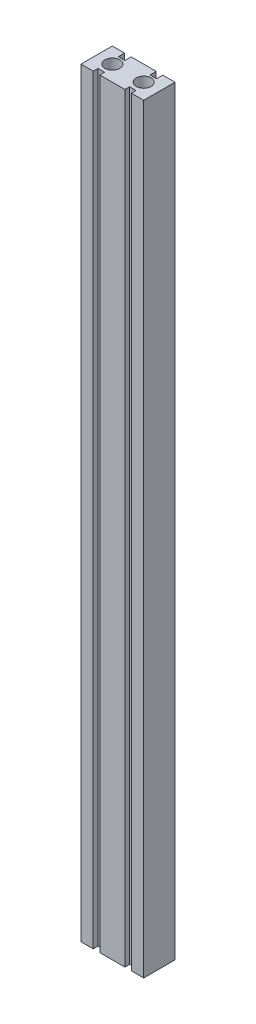
ISO-10303-21;
HEADER;
FILE_DESCRIPTION(('STEP AP214'),'2;1');
FILE_NAME('part.step','',(''),(''),'','','');
FILE_SCHEMA(('AUTOMOTIVE_DESIGN { 1 0 10303 214 1 1 1 1 }'));
ENDSEC;
DATA;
#1=APPLICATION_CONTEXT('core data for automotive mechanical design processes');
#2=APPLICATION_PROTOCOL_DEFINITION('international standard','automotive_design',2000,#1);
#3=PRODUCT_CONTEXT('',#1,'mechanical');
#4=PRODUCT('Part','Part','',(#3));
#5=PRODUCT_RELATED_PRODUCT_CATEGORY('part','',(#4));
#6=PRODUCT_DEFINITION_FORMATION('','',#4);
#7=PRODUCT_DEFINITION_CONTEXT('part definition',#1,'design');
#8=PRODUCT_DEFINITION('design','',#6,#7);
#9=PRODUCT_DEFINITION_SHAPE('','',#8);
#10=(LENGTH_UNIT() NAMED_UNIT(*) SI_UNIT(.MILLI.,.METRE.));
#11=(NAMED_UNIT(*) PLANE_ANGLE_UNIT() SI_UNIT($,.RADIAN.));
#12=(NAMED_UNIT(*) SI_UNIT($,.STERADIAN.) SOLID_ANGLE_UNIT());
#13=UNCERTAINTY_MEASURE_WITH_UNIT(LENGTH_MEASURE(1.E-05),#10,'distance_accuracy_value','');
#14=(GEOMETRIC_REPRESENTATION_CONTEXT(3) GLOBAL_UNCERTAINTY_ASSIGNED_CONTEXT((#13)) GLOBAL_UNIT_ASSIGNED_CONTEXT((#10,
#11,#12)) REPRESENTATION_CONTEXT('',''));
#15=CARTESIAN_POINT('',(0.,0.,0.));
#16=DIRECTION('',(0.,0.,1.));
#17=DIRECTION('',(1.,0.,0.));
#18=AXIS2_PLACEMENT_3D('',#15,#16,#17);
#19=CARTESIAN_POINT('',(-20.,485.,-10.));
#20=DIRECTION('',(0.,0.,1.));
#21=DIRECTION('',(1.,0.,0.));
#22=AXIS2_PLACEMENT_3D('',#19,#20,#21);
#23=PLANE('',#22);
#24=DIRECTION('',(-1.,0.,0.));
#25=VECTOR('',#24,1.);
#26=CARTESIAN_POINT('',(-20.,0.,-10.));
#27=LINE('',#26,#25);
#28=CARTESIAN_POINT('',(20.,0.,-10.));
#29=VERTEX_POINT('',#28);
#30=CARTESIAN_POINT('',(12.2,0.,-10.));
#31=VERTEX_POINT('',#30);
#32=EDGE_CURVE('E309',#29,#31,#27,.T.);
#33=ORIENTED_EDGE('',*,*,#32,.T.);
#34=DIRECTION('',(0.,-1.,0.));
#35=VECTOR('',#34,1.);
#36=CARTESIAN_POINT('',(12.2,485.,-10.));
#37=LINE('',#36,#35);
#38=CARTESIAN_POINT('',(12.2,485.,-10.));
#39=VERTEX_POINT('',#38);
#40=EDGE_CURVE('E219',#39,#31,#37,.T.);
#41=ORIENTED_EDGE('',*,*,#40,.F.);
#42=DIRECTION('',(-1.,0.,0.));
#43=VECTOR('',#42,1.);
#44=CARTESIAN_POINT('',(-20.,485.,-10.));
#45=LINE('',#44,#43);
#46=CARTESIAN_POINT('',(20.,485.,-10.));
#47=VERTEX_POINT('',#46);
#48=EDGE_CURVE('E294',#47,#39,#45,.T.);
#49=ORIENTED_EDGE('',*,*,#48,.F.);
#50=DIRECTION('',(0.,-1.,0.));
#51=VECTOR('',#50,1.);
#52=CARTESIAN_POINT('',(20.,485.,-10.));
#53=LINE('',#52,#51);
#54=EDGE_CURVE('E11',#47,#29,#53,.T.);
#55=ORIENTED_EDGE('',*,*,#54,.T.);
#56=EDGE_LOOP('',(#33,#41,#49,#55));
#57=FACE_BOUND('',#56,.T.);
#58=ADVANCED_FACE('F37',(#57),#23,.F.);
#59=CARTESIAN_POINT('',(-12.2,485.,-10.));
#60=VERTEX_POINT('',#59);
#61=CARTESIAN_POINT('',(-20.,485.,-10.));
#62=VERTEX_POINT('',#61);
#63=EDGE_CURVE('E292',#60,#62,#45,.T.);
#64=ORIENTED_EDGE('',*,*,#63,.F.);
#65=DIRECTION('',(0.,1.,0.));
#66=VECTOR('',#65,1.);
#67=CARTESIAN_POINT('',(-12.2,0.,-10.));
#68=LINE('',#67,#66);
#69=CARTESIAN_POINT('',(-12.2,0.,-10.));
#70=VERTEX_POINT('',#69);
#71=EDGE_CURVE('E214',#70,#60,#68,.T.);
#72=ORIENTED_EDGE('',*,*,#71,.F.);
#73=CARTESIAN_POINT('',(-20.,0.,-10.));
#74=VERTEX_POINT('',#73);
#75=EDGE_CURVE('E308',#70,#74,#27,.T.);
#76=ORIENTED_EDGE('',*,*,#75,.T.);
#77=DIRECTION('',(0.,-1.,0.));
#78=VECTOR('',#77,1.);
#79=CARTESIAN_POINT('',(-20.,485.,-10.));
#80=LINE('',#79,#78);
#81=EDGE_CURVE('E45',#62,#74,#80,.T.);
#82=ORIENTED_EDGE('',*,*,#81,.F.);
#83=EDGE_LOOP('',(#64,#72,#76,#82));
#84=FACE_BOUND('',#83,.T.);
#85=ADVANCED_FACE('F361',(#84),#23,.F.);
#86=CARTESIAN_POINT('',(-20.,485.,10.));
#87=DIRECTION('',(0.,0.,-1.));
#88=DIRECTION('',(-1.,0.,0.));
#89=AXIS2_PLACEMENT_3D('',#86,#87,#88);
#90=PLANE('',#89);
#91=DIRECTION('',(1.,0.,0.));
#92=VECTOR('',#91,1.);
#93=CARTESIAN_POINT('',(-20.,0.,10.));
#94=LINE('',#93,#92);
#95=CARTESIAN_POINT('',(-20.,0.,10.));
#96=VERTEX_POINT('',#95);
#97=CARTESIAN_POINT('',(-12.2,0.,10.));
#98=VERTEX_POINT('',#97);
#99=EDGE_CURVE('E293',#96,#98,#94,.T.);
#100=ORIENTED_EDGE('',*,*,#99,.T.);
#101=DIRECTION('',(0.,-1.,0.));
#102=VECTOR('',#101,1.);
#103=CARTESIAN_POINT('',(-12.2,0.,10.));
#104=LINE('',#103,#102);
#105=CARTESIAN_POINT('',(-12.2,485.,10.));
#106=VERTEX_POINT('',#105);
#107=EDGE_CURVE('E239',#106,#98,#104,.T.);
#108=ORIENTED_EDGE('',*,*,#107,.F.);
#109=DIRECTION('',(1.,0.,0.));
#110=VECTOR('',#109,1.);
#111=CARTESIAN_POINT('',(-20.,485.,10.));
#112=LINE('',#111,#110);
#113=CARTESIAN_POINT('',(-20.,485.,10.));
#114=VERTEX_POINT('',#113);
#115=EDGE_CURVE('E301',#114,#106,#112,.T.);
#116=ORIENTED_EDGE('',*,*,#115,.F.);
#117=DIRECTION('',(0.,-1.,0.));
#118=VECTOR('',#117,1.);
#119=CARTESIAN_POINT('',(-20.,485.,10.));
#120=LINE('',#119,#118);
#121=EDGE_CURVE('E320',#114,#96,#120,.T.);
#122=ORIENTED_EDGE('',*,*,#121,.T.);
#123=EDGE_LOOP('',(#100,#108,#116,#122));
#124=FACE_BOUND('',#123,.T.);
#125=ADVANCED_FACE('F338',(#124),#90,.F.);
#126=CARTESIAN_POINT('',(12.2,485.,10.));
#127=VERTEX_POINT('',#126);
#128=CARTESIAN_POINT('',(20.,485.,10.));
#129=VERTEX_POINT('',#128);
#130=EDGE_CURVE('E300',#127,#129,#112,.T.);
#131=ORIENTED_EDGE('',*,*,#130,.F.);
#132=DIRECTION('',(0.,1.,0.));
#133=VECTOR('',#132,1.);
#134=CARTESIAN_POINT('',(12.2,0.,10.));
#135=LINE('',#134,#133);
#136=CARTESIAN_POINT('',(12.2,0.,10.));
#137=VERTEX_POINT('',#136);
#138=EDGE_CURVE('E266',#137,#127,#135,.T.);
#139=ORIENTED_EDGE('',*,*,#138,.F.);
#140=CARTESIAN_POINT('',(20.,0.,10.));
#141=VERTEX_POINT('',#140);
#142=EDGE_CURVE('E314',#137,#141,#94,.T.);
#143=ORIENTED_EDGE('',*,*,#142,.T.);
#144=DIRECTION('',(0.,-1.,0.));
#145=VECTOR('',#144,1.);
#146=CARTESIAN_POINT('',(20.,485.,10.));
#147=LINE('',#146,#145);
#148=EDGE_CURVE('E304',#129,#141,#147,.T.);
#149=ORIENTED_EDGE('',*,*,#148,.F.);
#150=EDGE_LOOP('',(#131,#139,#143,#149));
#151=FACE_BOUND('',#150,.T.);
#152=ADVANCED_FACE('F367',(#151),#90,.F.);
#153=CARTESIAN_POINT('',(20.,485.,-10.));
#154=DIRECTION('',(-1.,0.,0.));
#155=DIRECTION('',(0.,0.,1.));
#156=AXIS2_PLACEMENT_3D('',#153,#154,#155);
#157=PLANE('',#156);
#158=DIRECTION('',(0.,0.,-1.));
#159=VECTOR('',#158,1.);
#160=CARTESIAN_POINT('',(20.,0.,-10.));
#161=LINE('',#160,#159);
#162=EDGE_CURVE('E280',#141,#29,#161,.T.);
#163=ORIENTED_EDGE('',*,*,#162,.T.);
#164=ORIENTED_EDGE('',*,*,#54,.F.);
#165=DIRECTION('',(0.,0.,-1.));
#166=VECTOR('',#165,1.);
#167=CARTESIAN_POINT('',(20.,485.,-10.));
#168=LINE('',#167,#166);
#169=EDGE_CURVE('E289',#129,#47,#168,.T.);
#170=ORIENTED_EDGE('',*,*,#169,.F.);
#171=ORIENTED_EDGE('',*,*,#148,.T.);
#172=EDGE_LOOP('',(#163,#164,#170,#171));
#173=FACE_BOUND('',#172,.T.);
#174=ADVANCED_FACE('F39',(#173),#157,.F.);
#175=CARTESIAN_POINT('',(8.,485.,-10.));
#176=VERTEX_POINT('',#175);
#177=CARTESIAN_POINT('',(-8.,485.,-10.));
#178=VERTEX_POINT('',#177);
#179=EDGE_CURVE('E298',#176,#178,#45,.T.);
#180=ORIENTED_EDGE('',*,*,#179,.F.);
#181=DIRECTION('',(0.,1.,0.));
#182=VECTOR('',#181,1.);
#183=CARTESIAN_POINT('',(8.,0.,-10.));
#184=LINE('',#183,#182);
#185=CARTESIAN_POINT('',(8.,0.,-10.));
#186=VERTEX_POINT('',#185);
#187=EDGE_CURVE('E354',#186,#176,#184,.T.);
#188=ORIENTED_EDGE('',*,*,#187,.F.);
#189=CARTESIAN_POINT('',(-8.,0.,-10.));
#190=VERTEX_POINT('',#189);
#191=EDGE_CURVE('E196',#186,#190,#27,.T.);
#192=ORIENTED_EDGE('',*,*,#191,.T.);
#193=DIRECTION('',(0.,-1.,0.));
#194=VECTOR('',#193,1.);
#195=CARTESIAN_POINT('',(-8.,485.,-10.));
#196=LINE('',#195,#194);
#197=EDGE_CURVE('E208',#178,#190,#196,.T.);
#198=ORIENTED_EDGE('',*,*,#197,.F.);
#199=EDGE_LOOP('',(#180,#188,#192,#198));
#200=FACE_BOUND('',#199,.T.);
#201=ADVANCED_FACE('F353',(#200),#23,.F.);
#202=CARTESIAN_POINT('',(-20.,485.,-10.));
#203=DIRECTION('',(1.,0.,0.));
#204=DIRECTION('',(0.,0.,-1.));
#205=AXIS2_PLACEMENT_3D('',#202,#203,#204);
#206=PLANE('',#205);
#207=DIRECTION('',(0.,0.,1.));
#208=VECTOR('',#207,1.);
#209=CARTESIAN_POINT('',(-20.,0.,-10.));
#210=LINE('',#209,#208);
#211=EDGE_CURVE('E312',#74,#96,#210,.T.);
#212=ORIENTED_EDGE('',*,*,#211,.T.);
#213=ORIENTED_EDGE('',*,*,#121,.F.);
#214=DIRECTION('',(0.,0.,1.));
#215=VECTOR('',#214,1.);
#216=CARTESIAN_POINT('',(-20.,485.,-10.));
#217=LINE('',#216,#215);
#218=EDGE_CURVE('E297',#62,#114,#217,.T.);
#219=ORIENTED_EDGE('',*,*,#218,.F.);
#220=ORIENTED_EDGE('',*,*,#81,.T.);
#221=EDGE_LOOP('',(#212,#213,#219,#220));
#222=FACE_BOUND('',#221,.T.);
#223=ADVANCED_FACE('F327',(#222),#206,.F.);
#224=CARTESIAN_POINT('',(-8.,485.,10.));
#225=VERTEX_POINT('',#224);
#226=CARTESIAN_POINT('',(8.,485.,10.));
#227=VERTEX_POINT('',#226);
#228=EDGE_CURVE('E305',#225,#227,#112,.T.);
#229=ORIENTED_EDGE('',*,*,#228,.F.);
#230=DIRECTION('',(0.,1.,0.));
#231=VECTOR('',#230,1.);
#232=CARTESIAN_POINT('',(-8.,0.,10.));
#233=LINE('',#232,#231);
#234=CARTESIAN_POINT('',(-8.,0.,10.));
#235=VERTEX_POINT('',#234);
#236=EDGE_CURVE('E229',#235,#225,#233,.T.);
#237=ORIENTED_EDGE('',*,*,#236,.F.);
#238=CARTESIAN_POINT('',(8.,0.,10.));
#239=VERTEX_POINT('',#238);
#240=EDGE_CURVE('E317',#235,#239,#94,.T.);
#241=ORIENTED_EDGE('',*,*,#240,.T.);
#242=DIRECTION('',(0.,-1.,0.));
#243=VECTOR('',#242,1.);
#244=CARTESIAN_POINT('',(8.,0.,10.));
#245=LINE('',#244,#243);
#246=EDGE_CURVE('E257',#227,#239,#245,.T.);
#247=ORIENTED_EDGE('',*,*,#246,.F.);
#248=EDGE_LOOP('',(#229,#237,#241,#247));
#249=FACE_BOUND('',#248,.T.);
#250=ADVANCED_FACE('F369',(#249),#90,.F.);
#251=CARTESIAN_POINT('',(0.,485.,0.));
#252=DIRECTION('',(0.,1.,0.));
#253=DIRECTION('',(0.,0.,1.));
#254=AXIS2_PLACEMENT_3D('',#251,#252,#253);
#255=PLANE('',#254);
#256=DIRECTION('',(0.,0.,-1.));
#257=VECTOR('',#256,1.);
#258=CARTESIAN_POINT('',(12.2,485.,-6.));
#259=LINE('',#258,#257);
#260=CARTESIAN_POINT('',(12.2,485.,-6.));
#261=VERTEX_POINT('',#260);
#262=EDGE_CURVE('E199',#261,#39,#259,.T.);
#263=ORIENTED_EDGE('',*,*,#262,.F.);
#264=DIRECTION('',(1.,0.,0.));
#265=VECTOR('',#264,1.);
#266=CARTESIAN_POINT('',(8.,485.,-6.));
#267=LINE('',#266,#265);
#268=CARTESIAN_POINT('',(8.,485.,-6.));
#269=VERTEX_POINT('',#268);
#270=EDGE_CURVE('E183',#269,#261,#267,.T.);
#271=ORIENTED_EDGE('',*,*,#270,.F.);
#272=DIRECTION('',(0.,0.,-1.));
#273=VECTOR('',#272,1.);
#274=CARTESIAN_POINT('',(8.,485.,-6.));
#275=LINE('',#274,#273);
#276=EDGE_CURVE('E181',#269,#176,#275,.T.);
#277=ORIENTED_EDGE('',*,*,#276,.T.);
#278=ORIENTED_EDGE('',*,*,#179,.T.);
#279=DIRECTION('',(0.,0.,-1.));
#280=VECTOR('',#279,1.);
#281=CARTESIAN_POINT('',(-8.,485.,-6.));
#282=LINE('',#281,#280);
#283=CARTESIAN_POINT('',(-8.,485.,-6.));
#284=VERTEX_POINT('',#283);
#285=EDGE_CURVE('E222',#284,#178,#282,.T.);
#286=ORIENTED_EDGE('',*,*,#285,.F.);
#287=DIRECTION('',(1.,0.,0.));
#288=VECTOR('',#287,1.);
#289=CARTESIAN_POINT('',(-12.2,485.,-6.));
#290=LINE('',#289,#288);
#291=CARTESIAN_POINT('',(-12.2,485.,-6.));
#292=VERTEX_POINT('',#291);
#293=EDGE_CURVE('E207',#292,#284,#290,.T.);
#294=ORIENTED_EDGE('',*,*,#293,.F.);
#295=DIRECTION('',(0.,0.,-1.));
#296=VECTOR('',#295,1.);
#297=CARTESIAN_POINT('',(-12.2,485.,-6.));
#298=LINE('',#297,#296);
#299=EDGE_CURVE('E213',#292,#60,#298,.T.);
#300=ORIENTED_EDGE('',*,*,#299,.T.);
#301=ORIENTED_EDGE('',*,*,#63,.T.);
#302=ORIENTED_EDGE('',*,*,#218,.T.);
#303=ORIENTED_EDGE('',*,*,#115,.T.);
#304=DIRECTION('',(0.,0.,1.));
#305=VECTOR('',#304,1.);
#306=CARTESIAN_POINT('',(-12.2,485.,7.));
#307=LINE('',#306,#305);
#308=CARTESIAN_POINT('',(-12.2,485.,7.));
#309=VERTEX_POINT('',#308);
#310=EDGE_CURVE('E243',#309,#106,#307,.T.);
#311=ORIENTED_EDGE('',*,*,#310,.F.);
#312=DIRECTION('',(-1.,0.,0.));
#313=VECTOR('',#312,1.);
#314=CARTESIAN_POINT('',(-12.2,485.,7.));
#315=LINE('',#314,#313);
#316=CARTESIAN_POINT('',(-8.,485.,7.));
#317=VERTEX_POINT('',#316);
#318=EDGE_CURVE('E235',#317,#309,#315,.T.);
#319=ORIENTED_EDGE('',*,*,#318,.F.);
#320=DIRECTION('',(0.,0.,1.));
#321=VECTOR('',#320,1.);
#322=CARTESIAN_POINT('',(-8.,485.,7.));
#323=LINE('',#322,#321);
#324=EDGE_CURVE('E246',#317,#225,#323,.T.);
#325=ORIENTED_EDGE('',*,*,#324,.T.);
#326=ORIENTED_EDGE('',*,*,#228,.T.);
#327=DIRECTION('',(0.,0.,1.));
#328=VECTOR('',#327,1.);
#329=CARTESIAN_POINT('',(8.,485.,7.));
#330=LINE('',#329,#328);
#331=CARTESIAN_POINT('',(8.,485.,7.));
#332=VERTEX_POINT('',#331);
#333=EDGE_CURVE('E273',#332,#227,#330,.T.);
#334=ORIENTED_EDGE('',*,*,#333,.F.);
#335=DIRECTION('',(-1.,0.,0.));
#336=VECTOR('',#335,1.);
#337=CARTESIAN_POINT('',(12.2,485.,7.));
#338=LINE('',#337,#336);
#339=CARTESIAN_POINT('',(12.2,485.,7.));
#340=VERTEX_POINT('',#339);
#341=EDGE_CURVE('E256',#340,#332,#338,.T.);
#342=ORIENTED_EDGE('',*,*,#341,.F.);
#343=DIRECTION('',(0.,0.,1.));
#344=VECTOR('',#343,1.);
#345=CARTESIAN_POINT('',(12.2,485.,7.));
#346=LINE('',#345,#344);
#347=EDGE_CURVE('E265',#340,#127,#346,.T.);
#348=ORIENTED_EDGE('',*,*,#347,.T.);
#349=ORIENTED_EDGE('',*,*,#130,.T.);
#350=ORIENTED_EDGE('',*,*,#169,.T.);
#351=ORIENTED_EDGE('',*,*,#48,.T.);
#352=EDGE_LOOP('',(#263,#271,#277,#278,#286,#294,#300,#301,#302,#303,#311,#319,#325,#326,#334,
#342,#348,#349,#350,#351));
#353=FACE_BOUND('',#352,.T.);
#354=CARTESIAN_POINT('',(-10.,485.,0.));
#355=DIRECTION('',(0.,-1.,0.));
#356=DIRECTION('',(0.,0.,-1.));
#357=AXIS2_PLACEMENT_3D('',#354,#355,#356);
#358=CIRCLE('',#357,4.75);
#359=CARTESIAN_POINT('',(-10.,485.,-4.75));
#360=VERTEX_POINT('',#359);
#361=EDGE_CURVE('E277',#360,#360,#358,.T.);
#362=ORIENTED_EDGE('',*,*,#361,.T.);
#363=EDGE_LOOP('',(#362));
#364=FACE_BOUND('',#363,.T.);
#365=CARTESIAN_POINT('',(10.,485.,0.));
#366=DIRECTION('',(0.,-1.,0.));
#367=DIRECTION('',(0.,0.,1.));
#368=AXIS2_PLACEMENT_3D('',#365,#366,#367);
#369=CIRCLE('',#368,4.75);
#370=CARTESIAN_POINT('',(10.,485.,4.75));
#371=VERTEX_POINT('',#370);
#372=EDGE_CURVE('E284',#371,#371,#369,.T.);
#373=ORIENTED_EDGE('',*,*,#372,.T.);
#374=EDGE_LOOP('',(#373));
#375=FACE_BOUND('',#374,.T.);
#376=ADVANCED_FACE('F343',(#353,#364,#375),#255,.T.);
#377=CARTESIAN_POINT('',(0.,0.,0.));
#378=DIRECTION('',(0.,1.,0.));
#379=DIRECTION('',(0.,0.,1.));
#380=AXIS2_PLACEMENT_3D('',#377,#378,#379);
#381=PLANE('',#380);
#382=DIRECTION('',(-1.,0.,0.));
#383=VECTOR('',#382,1.);
#384=CARTESIAN_POINT('',(12.2,0.,-6.));
#385=LINE('',#384,#383);
#386=CARTESIAN_POINT('',(12.2,0.,-6.));
#387=VERTEX_POINT('',#386);
#388=CARTESIAN_POINT('',(8.,0.,-6.));
#389=VERTEX_POINT('',#388);
#390=EDGE_CURVE('E184',#387,#389,#385,.T.);
#391=ORIENTED_EDGE('',*,*,#390,.F.);
#392=DIRECTION('',(0.,0.,-1.));
#393=VECTOR('',#392,1.);
#394=CARTESIAN_POINT('',(12.2,0.,-6.));
#395=LINE('',#394,#393);
#396=EDGE_CURVE('E197',#387,#31,#395,.T.);
#397=ORIENTED_EDGE('',*,*,#396,.T.);
#398=ORIENTED_EDGE('',*,*,#32,.F.);
#399=ORIENTED_EDGE('',*,*,#162,.F.);
#400=ORIENTED_EDGE('',*,*,#142,.F.);
#401=DIRECTION('',(0.,0.,1.));
#402=VECTOR('',#401,1.);
#403=CARTESIAN_POINT('',(12.2,0.,7.));
#404=LINE('',#403,#402);
#405=CARTESIAN_POINT('',(12.2,0.,7.));
#406=VERTEX_POINT('',#405);
#407=EDGE_CURVE('E241',#406,#137,#404,.T.);
#408=ORIENTED_EDGE('',*,*,#407,.F.);
#409=DIRECTION('',(1.,0.,0.));
#410=VECTOR('',#409,1.);
#411=CARTESIAN_POINT('',(12.2,0.,7.));
#412=LINE('',#411,#410);
#413=CARTESIAN_POINT('',(8.,0.,7.));
#414=VERTEX_POINT('',#413);
#415=EDGE_CURVE('E262',#414,#406,#412,.T.);
#416=ORIENTED_EDGE('',*,*,#415,.F.);
#417=DIRECTION('',(0.,0.,1.));
#418=VECTOR('',#417,1.);
#419=CARTESIAN_POINT('',(8.,0.,7.));
#420=LINE('',#419,#418);
#421=EDGE_CURVE('E270',#414,#239,#420,.T.);
#422=ORIENTED_EDGE('',*,*,#421,.T.);
#423=ORIENTED_EDGE('',*,*,#240,.F.);
#424=DIRECTION('',(0.,0.,1.));
#425=VECTOR('',#424,1.);
#426=CARTESIAN_POINT('',(-8.,0.,7.));
#427=LINE('',#426,#425);
#428=CARTESIAN_POINT('',(-8.,0.,7.));
#429=VERTEX_POINT('',#428);
#430=EDGE_CURVE('E249',#429,#235,#427,.T.);
#431=ORIENTED_EDGE('',*,*,#430,.F.);
#432=DIRECTION('',(1.,0.,0.));
#433=VECTOR('',#432,1.);
#434=CARTESIAN_POINT('',(-12.2,0.,7.));
#435=LINE('',#434,#433);
#436=CARTESIAN_POINT('',(-12.2,0.,7.));
#437=VERTEX_POINT('',#436);
#438=EDGE_CURVE('E228',#437,#429,#435,.T.);
#439=ORIENTED_EDGE('',*,*,#438,.F.);
#440=DIRECTION('',(0.,0.,1.));
#441=VECTOR('',#440,1.);
#442=CARTESIAN_POINT('',(-12.2,0.,7.));
#443=LINE('',#442,#441);
#444=EDGE_CURVE('E238',#437,#98,#443,.T.);
#445=ORIENTED_EDGE('',*,*,#444,.T.);
#446=ORIENTED_EDGE('',*,*,#99,.F.);
#447=ORIENTED_EDGE('',*,*,#211,.F.);
#448=ORIENTED_EDGE('',*,*,#75,.F.);
#449=DIRECTION('',(0.,0.,-1.));
#450=VECTOR('',#449,1.);
#451=CARTESIAN_POINT('',(-12.2,0.,-6.));
#452=LINE('',#451,#450);
#453=CARTESIAN_POINT('',(-12.2,0.,-6.));
#454=VERTEX_POINT('',#453);
#455=EDGE_CURVE('E217',#454,#70,#452,.T.);
#456=ORIENTED_EDGE('',*,*,#455,.F.);
#457=DIRECTION('',(-1.,0.,0.));
#458=VECTOR('',#457,1.);
#459=CARTESIAN_POINT('',(-8.,0.,-6.));
#460=LINE('',#459,#458);
#461=CARTESIAN_POINT('',(-8.,0.,-6.));
#462=VERTEX_POINT('',#461);
#463=EDGE_CURVE('E211',#462,#454,#460,.T.);
#464=ORIENTED_EDGE('',*,*,#463,.F.);
#465=DIRECTION('',(0.,0.,-1.));
#466=VECTOR('',#465,1.);
#467=CARTESIAN_POINT('',(-8.,0.,-6.));
#468=LINE('',#467,#466);
#469=EDGE_CURVE('E220',#462,#190,#468,.T.);
#470=ORIENTED_EDGE('',*,*,#469,.T.);
#471=ORIENTED_EDGE('',*,*,#191,.F.);
#472=DIRECTION('',(0.,0.,-1.));
#473=VECTOR('',#472,1.);
#474=CARTESIAN_POINT('',(8.,0.,-6.));
#475=LINE('',#474,#473);
#476=EDGE_CURVE('E178',#389,#186,#475,.T.);
#477=ORIENTED_EDGE('',*,*,#476,.F.);
#478=EDGE_LOOP('',(#391,#397,#398,#399,#400,#408,#416,#422,#423,#431,#439,#445,#446,#447,#448,
#456,#464,#470,#471,#477));
#479=FACE_BOUND('',#478,.T.);
#480=CARTESIAN_POINT('',(-10.,0.,0.));
#481=DIRECTION('',(0.,-1.,0.));
#482=DIRECTION('',(0.,0.,-1.));
#483=AXIS2_PLACEMENT_3D('',#480,#481,#482);
#484=CIRCLE('',#483,4.75);
#485=CARTESIAN_POINT('',(-10.,0.,-4.75));
#486=VERTEX_POINT('',#485);
#487=EDGE_CURVE('E281',#486,#486,#484,.T.);
#488=ORIENTED_EDGE('',*,*,#487,.F.);
#489=EDGE_LOOP('',(#488));
#490=FACE_BOUND('',#489,.T.);
#491=CARTESIAN_POINT('',(10.,0.,0.));
#492=DIRECTION('',(0.,-1.,0.));
#493=DIRECTION('',(0.,0.,1.));
#494=AXIS2_PLACEMENT_3D('',#491,#492,#493);
#495=CIRCLE('',#494,4.75);
#496=CARTESIAN_POINT('',(10.,0.,4.75));
#497=VERTEX_POINT('',#496);
#498=EDGE_CURVE('E245',#497,#497,#495,.T.);
#499=ORIENTED_EDGE('',*,*,#498,.F.);
#500=EDGE_LOOP('',(#499));
#501=FACE_BOUND('',#500,.T.);
#502=ADVANCED_FACE('F192',(#479,#490,#501),#381,.F.);
#503=CARTESIAN_POINT('',(10.,485.,0.));
#504=DIRECTION('',(0.,-1.,0.));
#505=DIRECTION('',(0.,0.,-1.));
#506=AXIS2_PLACEMENT_3D('',#503,#504,#505);
#507=CYLINDRICAL_SURFACE('',#506,4.75);
#508=ORIENTED_EDGE('',*,*,#372,.F.);
#509=EDGE_LOOP('',(#508));
#510=FACE_BOUND('',#509,.T.);
#511=ORIENTED_EDGE('',*,*,#498,.T.);
#512=EDGE_LOOP('',(#511));
#513=FACE_BOUND('',#512,.T.);
#514=ADVANCED_FACE('F432',(#510,#513),#507,.F.);
#515=CARTESIAN_POINT('',(-10.,485.,0.));
#516=DIRECTION('',(0.,-1.,0.));
#517=DIRECTION('',(0.,0.,-1.));
#518=AXIS2_PLACEMENT_3D('',#515,#516,#517);
#519=CYLINDRICAL_SURFACE('',#518,4.75);
#520=ORIENTED_EDGE('',*,*,#361,.F.);
#521=EDGE_LOOP('',(#520));
#522=FACE_BOUND('',#521,.T.);
#523=ORIENTED_EDGE('',*,*,#487,.T.);
#524=EDGE_LOOP('',(#523));
#525=FACE_BOUND('',#524,.T.);
#526=ADVANCED_FACE('F428',(#522,#525),#519,.F.);
#527=CARTESIAN_POINT('',(12.2,0.,7.));
#528=DIRECTION('',(1.,0.,0.));
#529=DIRECTION('',(0.,0.,-1.));
#530=AXIS2_PLACEMENT_3D('',#527,#528,#529);
#531=PLANE('',#530);
#532=ORIENTED_EDGE('',*,*,#138,.T.);
#533=ORIENTED_EDGE('',*,*,#347,.F.);
#534=DIRECTION('',(0.,1.,0.));
#535=VECTOR('',#534,1.);
#536=CARTESIAN_POINT('',(12.2,0.,7.));
#537=LINE('',#536,#535);
#538=EDGE_CURVE('E253',#406,#340,#537,.T.);
#539=ORIENTED_EDGE('',*,*,#538,.F.);
#540=ORIENTED_EDGE('',*,*,#407,.T.);
#541=EDGE_LOOP('',(#532,#533,#539,#540));
#542=FACE_BOUND('',#541,.T.);
#543=ADVANCED_FACE('F425',(#542),#531,.F.);
#544=CARTESIAN_POINT('',(8.,0.,7.));
#545=DIRECTION('',(-1.,0.,0.));
#546=DIRECTION('',(0.,0.,1.));
#547=AXIS2_PLACEMENT_3D('',#544,#545,#546);
#548=PLANE('',#547);
#549=ORIENTED_EDGE('',*,*,#246,.T.);
#550=ORIENTED_EDGE('',*,*,#421,.F.);
#551=DIRECTION('',(0.,-1.,0.));
#552=VECTOR('',#551,1.);
#553=CARTESIAN_POINT('',(8.,0.,7.));
#554=LINE('',#553,#552);
#555=EDGE_CURVE('E260',#332,#414,#554,.T.);
#556=ORIENTED_EDGE('',*,*,#555,.F.);
#557=ORIENTED_EDGE('',*,*,#333,.T.);
#558=EDGE_LOOP('',(#549,#550,#556,#557));
#559=FACE_BOUND('',#558,.T.);
#560=ADVANCED_FACE('F403',(#559),#548,.F.);
#561=CARTESIAN_POINT('',(0.,0.,7.));
#562=DIRECTION('',(0.,0.,1.));
#563=DIRECTION('',(1.,0.,0.));
#564=AXIS2_PLACEMENT_3D('',#561,#562,#563);
#565=PLANE('',#564);
#566=ORIENTED_EDGE('',*,*,#538,.T.);
#567=ORIENTED_EDGE('',*,*,#341,.T.);
#568=ORIENTED_EDGE('',*,*,#555,.T.);
#569=ORIENTED_EDGE('',*,*,#415,.T.);
#570=EDGE_LOOP('',(#566,#567,#568,#569));
#571=FACE_BOUND('',#570,.T.);
#572=ADVANCED_FACE('F412',(#571),#565,.T.);
#573=CARTESIAN_POINT('',(-12.2,0.,7.));
#574=DIRECTION('',(-1.,0.,0.));
#575=DIRECTION('',(0.,0.,1.));
#576=AXIS2_PLACEMENT_3D('',#573,#574,#575);
#577=PLANE('',#576);
#578=ORIENTED_EDGE('',*,*,#107,.T.);
#579=ORIENTED_EDGE('',*,*,#444,.F.);
#580=DIRECTION('',(0.,-1.,0.));
#581=VECTOR('',#580,1.);
#582=CARTESIAN_POINT('',(-12.2,0.,7.));
#583=LINE('',#582,#581);
#584=EDGE_CURVE('E226',#309,#437,#583,.T.);
#585=ORIENTED_EDGE('',*,*,#584,.F.);
#586=ORIENTED_EDGE('',*,*,#310,.T.);
#587=EDGE_LOOP('',(#578,#579,#585,#586));
#588=FACE_BOUND('',#587,.T.);
#589=ADVANCED_FACE('F410',(#588),#577,.F.);
#590=CARTESIAN_POINT('',(-8.,0.,7.));
#591=DIRECTION('',(1.,0.,0.));
#592=DIRECTION('',(0.,0.,-1.));
#593=AXIS2_PLACEMENT_3D('',#590,#591,#592);
#594=PLANE('',#593);
#595=ORIENTED_EDGE('',*,*,#236,.T.);
#596=ORIENTED_EDGE('',*,*,#324,.F.);
#597=DIRECTION('',(0.,1.,0.));
#598=VECTOR('',#597,1.);
#599=CARTESIAN_POINT('',(-8.,0.,7.));
#600=LINE('',#599,#598);
#601=EDGE_CURVE('E232',#429,#317,#600,.T.);
#602=ORIENTED_EDGE('',*,*,#601,.F.);
#603=ORIENTED_EDGE('',*,*,#430,.T.);
#604=EDGE_LOOP('',(#595,#596,#602,#603));
#605=FACE_BOUND('',#604,.T.);
#606=ADVANCED_FACE('F406',(#605),#594,.F.);
#607=CARTESIAN_POINT('',(0.,0.,7.));
#608=DIRECTION('',(0.,0.,-1.));
#609=DIRECTION('',(-1.,0.,0.));
#610=AXIS2_PLACEMENT_3D('',#607,#608,#609);
#611=PLANE('',#610);
#612=ORIENTED_EDGE('',*,*,#584,.T.);
#613=ORIENTED_EDGE('',*,*,#438,.T.);
#614=ORIENTED_EDGE('',*,*,#601,.T.);
#615=ORIENTED_EDGE('',*,*,#318,.T.);
#616=EDGE_LOOP('',(#612,#613,#614,#615));
#617=FACE_BOUND('',#616,.T.);
#618=ADVANCED_FACE('F408',(#617),#611,.F.);
#619=CARTESIAN_POINT('',(-12.2,0.,-6.));
#620=DIRECTION('',(-1.,0.,0.));
#621=DIRECTION('',(0.,0.,1.));
#622=AXIS2_PLACEMENT_3D('',#619,#620,#621);
#623=PLANE('',#622);
#624=ORIENTED_EDGE('',*,*,#71,.T.);
#625=ORIENTED_EDGE('',*,*,#299,.F.);
#626=DIRECTION('',(0.,1.,0.));
#627=VECTOR('',#626,1.);
#628=CARTESIAN_POINT('',(-12.2,0.,-6.));
#629=LINE('',#628,#627);
#630=EDGE_CURVE('E204',#454,#292,#629,.T.);
#631=ORIENTED_EDGE('',*,*,#630,.F.);
#632=ORIENTED_EDGE('',*,*,#455,.T.);
#633=EDGE_LOOP('',(#624,#625,#631,#632));
#634=FACE_BOUND('',#633,.T.);
#635=ADVANCED_FACE('F360',(#634),#623,.F.);
#636=CARTESIAN_POINT('',(-8.,485.,-6.));
#637=DIRECTION('',(1.,0.,0.));
#638=DIRECTION('',(0.,0.,-1.));
#639=AXIS2_PLACEMENT_3D('',#636,#637,#638);
#640=PLANE('',#639);
#641=ORIENTED_EDGE('',*,*,#197,.T.);
#642=ORIENTED_EDGE('',*,*,#469,.F.);
#643=DIRECTION('',(0.,-1.,0.));
#644=VECTOR('',#643,1.);
#645=CARTESIAN_POINT('',(-8.,485.,-6.));
#646=LINE('',#645,#644);
#647=EDGE_CURVE('E60',#284,#462,#646,.T.);
#648=ORIENTED_EDGE('',*,*,#647,.F.);
#649=ORIENTED_EDGE('',*,*,#285,.T.);
#650=EDGE_LOOP('',(#641,#642,#648,#649));
#651=FACE_BOUND('',#650,.T.);
#652=ADVANCED_FACE('F356',(#651),#640,.F.);
#653=CARTESIAN_POINT('',(0.,0.,-6.));
#654=DIRECTION('',(0.,0.,-1.));
#655=DIRECTION('',(-1.,0.,0.));
#656=AXIS2_PLACEMENT_3D('',#653,#654,#655);
#657=PLANE('',#656);
#658=ORIENTED_EDGE('',*,*,#630,.T.);
#659=ORIENTED_EDGE('',*,*,#293,.T.);
#660=ORIENTED_EDGE('',*,*,#647,.T.);
#661=ORIENTED_EDGE('',*,*,#463,.T.);
#662=EDGE_LOOP('',(#658,#659,#660,#661));
#663=FACE_BOUND('',#662,.T.);
#664=ADVANCED_FACE('F358',(#663),#657,.T.);
#665=CARTESIAN_POINT('',(12.2,485.,-6.));
#666=DIRECTION('',(1.,0.,0.));
#667=DIRECTION('',(0.,0.,-1.));
#668=AXIS2_PLACEMENT_3D('',#665,#666,#667);
#669=PLANE('',#668);
#670=ORIENTED_EDGE('',*,*,#40,.T.);
#671=ORIENTED_EDGE('',*,*,#396,.F.);
#672=DIRECTION('',(0.,-1.,0.));
#673=VECTOR('',#672,1.);
#674=CARTESIAN_POINT('',(12.2,485.,-6.));
#675=LINE('',#674,#673);
#676=EDGE_CURVE('E52',#261,#387,#675,.T.);
#677=ORIENTED_EDGE('',*,*,#676,.F.);
#678=ORIENTED_EDGE('',*,*,#262,.T.);
#679=EDGE_LOOP('',(#670,#671,#677,#678));
#680=FACE_BOUND('',#679,.T.);
#681=ADVANCED_FACE('F562',(#680),#669,.F.);
#682=CARTESIAN_POINT('',(8.,0.,-6.));
#683=DIRECTION('',(-1.,0.,0.));
#684=DIRECTION('',(0.,0.,1.));
#685=AXIS2_PLACEMENT_3D('',#682,#683,#684);
#686=PLANE('',#685);
#687=ORIENTED_EDGE('',*,*,#187,.T.);
#688=ORIENTED_EDGE('',*,*,#276,.F.);
#689=DIRECTION('',(0.,1.,0.));
#690=VECTOR('',#689,1.);
#691=CARTESIAN_POINT('',(8.,0.,-6.));
#692=LINE('',#691,#690);
#693=EDGE_CURVE('E175',#389,#269,#692,.T.);
#694=ORIENTED_EDGE('',*,*,#693,.F.);
#695=ORIENTED_EDGE('',*,*,#476,.T.);
#696=EDGE_LOOP('',(#687,#688,#694,#695));
#697=FACE_BOUND('',#696,.T.);
#698=ADVANCED_FACE('F176',(#697),#686,.F.);
#699=CARTESIAN_POINT('',(0.,0.,-6.));
#700=DIRECTION('',(0.,0.,-1.));
#701=DIRECTION('',(-1.,0.,0.));
#702=AXIS2_PLACEMENT_3D('',#699,#700,#701);
#703=PLANE('',#702);
#704=ORIENTED_EDGE('',*,*,#676,.T.);
#705=ORIENTED_EDGE('',*,*,#390,.T.);
#706=ORIENTED_EDGE('',*,*,#693,.T.);
#707=ORIENTED_EDGE('',*,*,#270,.T.);
#708=EDGE_LOOP('',(#704,#705,#706,#707));
#709=FACE_BOUND('',#708,.T.);
#710=ADVANCED_FACE('F187',(#709),#703,.T.);
#711=CLOSED_SHELL('',(#58,#85,#125,#152,#174,#201,#223,#250,#376,#502,#514,#526,#543,#560,#572,
#589,#606,#618,#635,#652,#664,#681,#698,#710));
#712=MANIFOLD_SOLID_BREP('B2',#711);
#713=ADVANCED_BREP_SHAPE_REPRESENTATION('',(#18,#712),#14);
#714=SHAPE_DEFINITION_REPRESENTATION(#9,#713);
ENDSEC;
END-ISO-10303-21;
